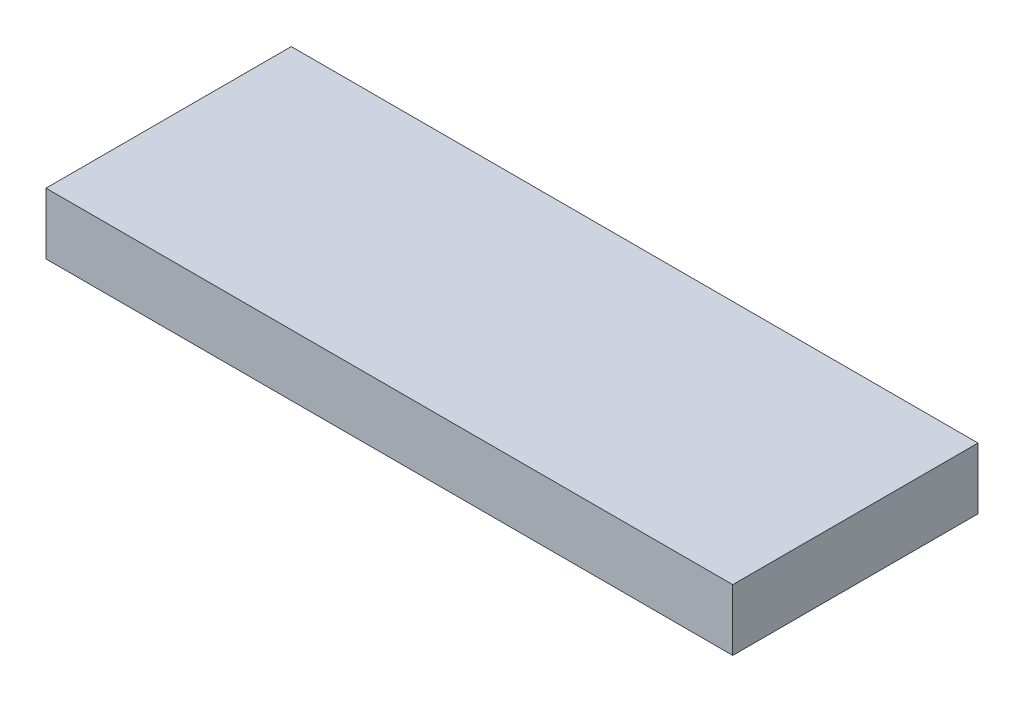
ISO-10303-21;
HEADER;
FILE_DESCRIPTION(('STEP AP214'),'2;1');
FILE_NAME('part.step','',(''),(''),'','','');
FILE_SCHEMA(('AUTOMOTIVE_DESIGN { 1 0 10303 214 1 1 1 1 }'));
ENDSEC;
DATA;
#1=APPLICATION_CONTEXT('core data for automotive mechanical design processes');
#2=APPLICATION_PROTOCOL_DEFINITION('international standard','automotive_design',2000,#1);
#3=PRODUCT_CONTEXT('',#1,'mechanical');
#4=PRODUCT('Part','Part','',(#3));
#5=PRODUCT_RELATED_PRODUCT_CATEGORY('part','',(#4));
#6=PRODUCT_DEFINITION_FORMATION('','',#4);
#7=PRODUCT_DEFINITION_CONTEXT('part definition',#1,'design');
#8=PRODUCT_DEFINITION('design','',#6,#7);
#9=PRODUCT_DEFINITION_SHAPE('','',#8);
#10=(LENGTH_UNIT() NAMED_UNIT(*) SI_UNIT(.MILLI.,.METRE.));
#11=(NAMED_UNIT(*) PLANE_ANGLE_UNIT() SI_UNIT($,.RADIAN.));
#12=(NAMED_UNIT(*) SI_UNIT($,.STERADIAN.) SOLID_ANGLE_UNIT());
#13=UNCERTAINTY_MEASURE_WITH_UNIT(LENGTH_MEASURE(1.E-05),#10,'distance_accuracy_value','');
#14=(GEOMETRIC_REPRESENTATION_CONTEXT(3) GLOBAL_UNCERTAINTY_ASSIGNED_CONTEXT((#13)) GLOBAL_UNIT_ASSIGNED_CONTEXT((#10,
#11,#12)) REPRESENTATION_CONTEXT('',''));
#15=CARTESIAN_POINT('',(0.,0.,0.));
#16=DIRECTION('',(0.,0.,1.));
#17=DIRECTION('',(1.,0.,0.));
#18=AXIS2_PLACEMENT_3D('',#15,#16,#17);
#19=CARTESIAN_POINT('',(-17.78,3.175,-6.35));
#20=DIRECTION('',(1.,0.,0.));
#21=DIRECTION('',(0.,0.,-1.));
#22=AXIS2_PLACEMENT_3D('',#19,#20,#21);
#23=PLANE('',#22);
#24=DIRECTION('',(0.,0.,1.));
#25=VECTOR('',#24,1.);
#26=CARTESIAN_POINT('',(-17.78,0.,-6.35));
#27=LINE('',#26,#25);
#28=CARTESIAN_POINT('',(-17.78,0.,-6.35));
#29=VERTEX_POINT('',#28);
#30=CARTESIAN_POINT('',(-17.78,0.,6.35));
#31=VERTEX_POINT('',#30);
#32=EDGE_CURVE('E96',#29,#31,#27,.T.);
#33=ORIENTED_EDGE('',*,*,#32,.T.);
#34=DIRECTION('',(0.,-1.,0.));
#35=VECTOR('',#34,1.);
#36=CARTESIAN_POINT('',(-17.78,3.175,6.35));
#37=LINE('',#36,#35);
#38=CARTESIAN_POINT('',(-17.78,3.175,6.35));
#39=VERTEX_POINT('',#38);
#40=EDGE_CURVE('E11',#39,#31,#37,.T.);
#41=ORIENTED_EDGE('',*,*,#40,.F.);
#42=DIRECTION('',(0.,0.,1.));
#43=VECTOR('',#42,1.);
#44=CARTESIAN_POINT('',(-17.78,3.175,-6.35));
#45=LINE('',#44,#43);
#46=CARTESIAN_POINT('',(-17.78,3.175,-6.35));
#47=VERTEX_POINT('',#46);
#48=EDGE_CURVE('E84',#47,#39,#45,.T.);
#49=ORIENTED_EDGE('',*,*,#48,.F.);
#50=DIRECTION('',(0.,-1.,0.));
#51=VECTOR('',#50,1.);
#52=CARTESIAN_POINT('',(-17.78,3.175,-6.35));
#53=LINE('',#52,#51);
#54=EDGE_CURVE('E92',#47,#29,#53,.T.);
#55=ORIENTED_EDGE('',*,*,#54,.T.);
#56=EDGE_LOOP('',(#33,#41,#49,#55));
#57=FACE_BOUND('',#56,.T.);
#58=ADVANCED_FACE('F33',(#57),#23,.F.);
#59=CARTESIAN_POINT('',(-17.78,3.175,6.35));
#60=DIRECTION('',(0.,0.,-1.));
#61=DIRECTION('',(-1.,0.,0.));
#62=AXIS2_PLACEMENT_3D('',#59,#60,#61);
#63=PLANE('',#62);
#64=DIRECTION('',(1.,0.,0.));
#65=VECTOR('',#64,1.);
#66=CARTESIAN_POINT('',(-17.78,0.,6.35));
#67=LINE('',#66,#65);
#68=CARTESIAN_POINT('',(17.78,0.,6.35));
#69=VERTEX_POINT('',#68);
#70=EDGE_CURVE('E88',#31,#69,#67,.T.);
#71=ORIENTED_EDGE('',*,*,#70,.T.);
#72=DIRECTION('',(0.,-1.,0.));
#73=VECTOR('',#72,1.);
#74=CARTESIAN_POINT('',(17.78,3.175,6.35));
#75=LINE('',#74,#73);
#76=CARTESIAN_POINT('',(17.78,3.175,6.35));
#77=VERTEX_POINT('',#76);
#78=EDGE_CURVE('E41',#77,#69,#75,.T.);
#79=ORIENTED_EDGE('',*,*,#78,.F.);
#80=DIRECTION('',(1.,0.,0.));
#81=VECTOR('',#80,1.);
#82=CARTESIAN_POINT('',(-17.78,3.175,6.35));
#83=LINE('',#82,#81);
#84=EDGE_CURVE('E79',#39,#77,#83,.T.);
#85=ORIENTED_EDGE('',*,*,#84,.F.);
#86=ORIENTED_EDGE('',*,*,#40,.T.);
#87=EDGE_LOOP('',(#71,#79,#85,#86));
#88=FACE_BOUND('',#87,.T.);
#89=ADVANCED_FACE('F87',(#88),#63,.F.);
#90=CARTESIAN_POINT('',(17.78,3.175,-6.35));
#91=DIRECTION('',(-1.,0.,0.));
#92=DIRECTION('',(0.,0.,1.));
#93=AXIS2_PLACEMENT_3D('',#90,#91,#92);
#94=PLANE('',#93);
#95=DIRECTION('',(0.,0.,-1.));
#96=VECTOR('',#95,1.);
#97=CARTESIAN_POINT('',(17.78,0.,-6.35));
#98=LINE('',#97,#96);
#99=CARTESIAN_POINT('',(17.78,0.,-6.35));
#100=VERTEX_POINT('',#99);
#101=EDGE_CURVE('E66',#69,#100,#98,.T.);
#102=ORIENTED_EDGE('',*,*,#101,.T.);
#103=DIRECTION('',(0.,-1.,0.));
#104=VECTOR('',#103,1.);
#105=CARTESIAN_POINT('',(17.78,3.175,-6.35));
#106=LINE('',#105,#104);
#107=CARTESIAN_POINT('',(17.78,3.175,-6.35));
#108=VERTEX_POINT('',#107);
#109=EDGE_CURVE('E89',#108,#100,#106,.T.);
#110=ORIENTED_EDGE('',*,*,#109,.F.);
#111=DIRECTION('',(0.,0.,-1.));
#112=VECTOR('',#111,1.);
#113=CARTESIAN_POINT('',(17.78,3.175,-6.35));
#114=LINE('',#113,#112);
#115=EDGE_CURVE('E82',#77,#108,#114,.T.);
#116=ORIENTED_EDGE('',*,*,#115,.F.);
#117=ORIENTED_EDGE('',*,*,#78,.T.);
#118=EDGE_LOOP('',(#102,#110,#116,#117));
#119=FACE_BOUND('',#118,.T.);
#120=ADVANCED_FACE('F90',(#119),#94,.F.);
#121=CARTESIAN_POINT('',(-17.78,3.175,-6.35));
#122=DIRECTION('',(0.,0.,1.));
#123=DIRECTION('',(1.,0.,0.));
#124=AXIS2_PLACEMENT_3D('',#121,#122,#123);
#125=PLANE('',#124);
#126=DIRECTION('',(-1.,0.,0.));
#127=VECTOR('',#126,1.);
#128=CARTESIAN_POINT('',(-17.78,0.,-6.35));
#129=LINE('',#128,#127);
#130=EDGE_CURVE('E72',#100,#29,#129,.T.);
#131=ORIENTED_EDGE('',*,*,#130,.T.);
#132=ORIENTED_EDGE('',*,*,#54,.F.);
#133=DIRECTION('',(-1.,0.,0.));
#134=VECTOR('',#133,1.);
#135=CARTESIAN_POINT('',(-17.78,3.175,-6.35));
#136=LINE('',#135,#134);
#137=EDGE_CURVE('E49',#108,#47,#136,.T.);
#138=ORIENTED_EDGE('',*,*,#137,.F.);
#139=ORIENTED_EDGE('',*,*,#109,.T.);
#140=EDGE_LOOP('',(#131,#132,#138,#139));
#141=FACE_BOUND('',#140,.T.);
#142=ADVANCED_FACE('F103',(#141),#125,.F.);
#143=CARTESIAN_POINT('',(0.,3.175,0.));
#144=DIRECTION('',(0.,1.,0.));
#145=DIRECTION('',(0.,0.,1.));
#146=AXIS2_PLACEMENT_3D('',#143,#144,#145);
#147=PLANE('',#146);
#148=ORIENTED_EDGE('',*,*,#48,.T.);
#149=ORIENTED_EDGE('',*,*,#84,.T.);
#150=ORIENTED_EDGE('',*,*,#115,.T.);
#151=ORIENTED_EDGE('',*,*,#137,.T.);
#152=EDGE_LOOP('',(#148,#149,#150,#151));
#153=FACE_BOUND('',#152,.T.);
#154=ADVANCED_FACE('F80',(#153),#147,.T.);
#155=CARTESIAN_POINT('',(0.,0.,0.));
#156=DIRECTION('',(0.,1.,0.));
#157=DIRECTION('',(0.,0.,1.));
#158=AXIS2_PLACEMENT_3D('',#155,#156,#157);
#159=PLANE('',#158);
#160=ORIENTED_EDGE('',*,*,#32,.F.);
#161=ORIENTED_EDGE('',*,*,#130,.F.);
#162=ORIENTED_EDGE('',*,*,#101,.F.);
#163=ORIENTED_EDGE('',*,*,#70,.F.);
#164=EDGE_LOOP('',(#160,#161,#162,#163));
#165=FACE_BOUND('',#164,.T.);
#166=ADVANCED_FACE('F106',(#165),#159,.F.);
#167=CLOSED_SHELL('',(#58,#89,#120,#142,#154,#166));
#168=MANIFOLD_SOLID_BREP('B2',#167);
#169=ADVANCED_BREP_SHAPE_REPRESENTATION('',(#18,#168),#14);
#170=SHAPE_DEFINITION_REPRESENTATION(#9,#169);
ENDSEC;
END-ISO-10303-21;
